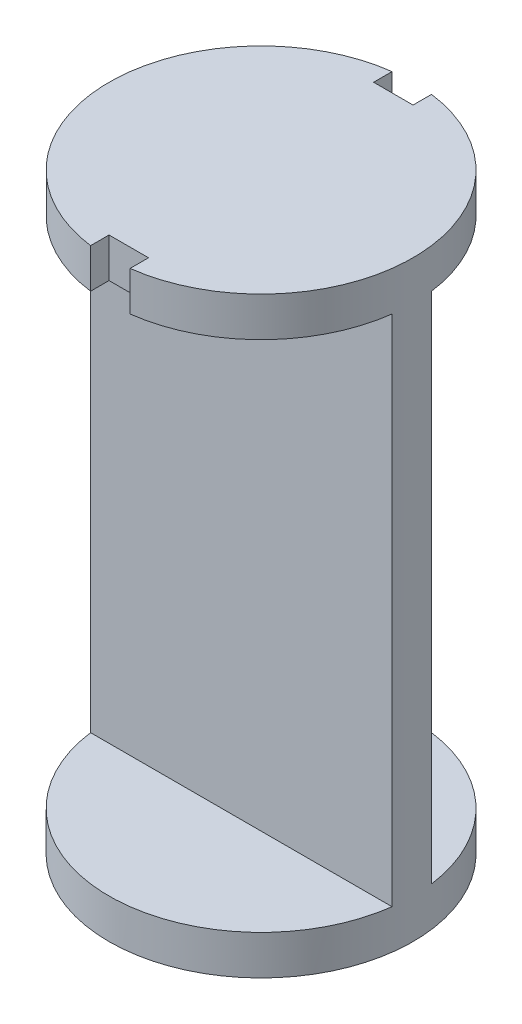
ISO-10303-21;
HEADER;
FILE_DESCRIPTION(('STEP AP214'),'2;1');
FILE_NAME('part.step','',(''),(''),'','','');
FILE_SCHEMA(('AUTOMOTIVE_DESIGN { 1 0 10303 214 1 1 1 1 }'));
ENDSEC;
DATA;
#1=APPLICATION_CONTEXT('core data for automotive mechanical design processes');
#2=APPLICATION_PROTOCOL_DEFINITION('international standard','automotive_design',2000,#1);
#3=PRODUCT_CONTEXT('',#1,'mechanical');
#4=PRODUCT('Part','Part','',(#3));
#5=PRODUCT_RELATED_PRODUCT_CATEGORY('part','',(#4));
#6=PRODUCT_DEFINITION_FORMATION('','',#4);
#7=PRODUCT_DEFINITION_CONTEXT('part definition',#1,'design');
#8=PRODUCT_DEFINITION('design','',#6,#7);
#9=PRODUCT_DEFINITION_SHAPE('','',#8);
#10=(LENGTH_UNIT() NAMED_UNIT(*) SI_UNIT(.MILLI.,.METRE.));
#11=(NAMED_UNIT(*) PLANE_ANGLE_UNIT() SI_UNIT($,.RADIAN.));
#12=(NAMED_UNIT(*) SI_UNIT($,.STERADIAN.) SOLID_ANGLE_UNIT());
#13=UNCERTAINTY_MEASURE_WITH_UNIT(LENGTH_MEASURE(1.E-05),#10,'distance_accuracy_value','');
#14=(GEOMETRIC_REPRESENTATION_CONTEXT(3) GLOBAL_UNCERTAINTY_ASSIGNED_CONTEXT((#13)) GLOBAL_UNIT_ASSIGNED_CONTEXT((#10,
#11,#12)) REPRESENTATION_CONTEXT('',''));
#15=CARTESIAN_POINT('',(0.,0.,0.));
#16=DIRECTION('',(0.,0.,1.));
#17=DIRECTION('',(1.,0.,0.));
#18=AXIS2_PLACEMENT_3D('',#15,#16,#17);
#19=CARTESIAN_POINT('',(0.,10.,0.));
#20=DIRECTION('',(0.,1.,0.));
#21=DIRECTION('',(0.,0.,1.));
#22=AXIS2_PLACEMENT_3D('',#19,#20,#21);
#23=PLANE('',#22);
#24=DIRECTION('',(-1.,0.,0.));
#25=VECTOR('',#24,1.);
#26=CARTESIAN_POINT('',(38.1739439932528,10.,-5.));
#27=LINE('',#26,#25);
#28=CARTESIAN_POINT('',(38.1739439932528,10.,-5.));
#29=VERTEX_POINT('',#28);
#30=CARTESIAN_POINT('',(-38.1739439932528,10.,-5.));
#31=VERTEX_POINT('',#30);
#32=EDGE_CURVE('E184',#29,#31,#27,.T.);
#33=ORIENTED_EDGE('',*,*,#32,.F.);
#34=CARTESIAN_POINT('',(0.,10.,0.));
#35=DIRECTION('',(0.,1.,0.));
#36=DIRECTION('',(0.,0.,1.));
#37=AXIS2_PLACEMENT_3D('',#34,#35,#36);
#38=CIRCLE('',#37,38.5);
#39=EDGE_CURVE('E11',#29,#31,#38,.T.);
#40=ORIENTED_EDGE('',*,*,#39,.T.);
#41=EDGE_LOOP('',(#33,#40));
#42=FACE_BOUND('',#41,.T.);
#43=ADVANCED_FACE('F43',(#42),#23,.T.);
#44=CARTESIAN_POINT('',(0.,10.,0.));
#45=DIRECTION('',(0.,-1.,0.));
#46=DIRECTION('',(0.,0.,-1.));
#47=AXIS2_PLACEMENT_3D('',#44,#45,#46);
#48=CYLINDRICAL_SURFACE('',#47,38.5);
#49=CARTESIAN_POINT('',(0.,0.,0.));
#50=DIRECTION('',(0.,1.,0.));
#51=DIRECTION('',(0.,0.,1.));
#52=AXIS2_PLACEMENT_3D('',#49,#50,#51);
#53=CIRCLE('',#52,38.5);
#54=CARTESIAN_POINT('',(0.,0.,38.5));
#55=VERTEX_POINT('',#54);
#56=EDGE_CURVE('E47',#55,#55,#53,.T.);
#57=ORIENTED_EDGE('',*,*,#56,.T.);
#58=EDGE_LOOP('',(#57));
#59=FACE_BOUND('',#58,.T.);
#60=CARTESIAN_POINT('',(0.,140.,0.));
#61=DIRECTION('',(0.,1.,0.));
#62=DIRECTION('',(0.,0.,1.));
#63=AXIS2_PLACEMENT_3D('',#60,#61,#62);
#64=CIRCLE('',#63,38.5);
#65=CARTESIAN_POINT('',(38.1739439932528,140.,-5.));
#66=VERTEX_POINT('',#65);
#67=CARTESIAN_POINT('',(5.,140.,-38.1739439932528));
#68=VERTEX_POINT('',#67);
#69=EDGE_CURVE('E151',#66,#68,#64,.T.);
#70=ORIENTED_EDGE('',*,*,#69,.T.);
#71=DIRECTION('',(0.,-1.,0.));
#72=VECTOR('',#71,1.);
#73=CARTESIAN_POINT('',(5.,10.,-38.1739439932528));
#74=LINE('',#73,#72);
#75=CARTESIAN_POINT('',(5.,150.,-38.1739439932528));
#76=VERTEX_POINT('',#75);
#77=EDGE_CURVE('E133',#76,#68,#74,.T.);
#78=ORIENTED_EDGE('',*,*,#77,.F.);
#79=CARTESIAN_POINT('',(0.,150.,0.));
#80=DIRECTION('',(0.,1.,0.));
#81=DIRECTION('',(0.,0.,1.));
#82=AXIS2_PLACEMENT_3D('',#79,#80,#81);
#83=CIRCLE('',#82,38.5);
#84=CARTESIAN_POINT('',(5.,150.,38.1739439932528));
#85=VERTEX_POINT('',#84);
#86=EDGE_CURVE('E173',#85,#76,#83,.T.);
#87=ORIENTED_EDGE('',*,*,#86,.F.);
#88=DIRECTION('',(0.,-1.,0.));
#89=VECTOR('',#88,1.);
#90=CARTESIAN_POINT('',(5.,10.,38.1739439932528));
#91=LINE('',#90,#89);
#92=CARTESIAN_POINT('',(5.,140.,38.1739439932528));
#93=VERTEX_POINT('',#92);
#94=EDGE_CURVE('E67',#93,#85,#91,.F.);
#95=ORIENTED_EDGE('',*,*,#94,.F.);
#96=CARTESIAN_POINT('',(38.1739439932528,140.,5.));
#97=VERTEX_POINT('',#96);
#98=EDGE_CURVE('E166',#93,#97,#64,.T.);
#99=ORIENTED_EDGE('',*,*,#98,.T.);
#100=DIRECTION('',(0.,-1.,0.));
#101=VECTOR('',#100,1.);
#102=CARTESIAN_POINT('',(38.1739439932528,150.002,5.));
#103=LINE('',#102,#101);
#104=CARTESIAN_POINT('',(38.1739439932528,10.,5.));
#105=VERTEX_POINT('',#104);
#106=EDGE_CURVE('E191',#97,#105,#103,.T.);
#107=ORIENTED_EDGE('',*,*,#106,.T.);
#108=CARTESIAN_POINT('',(-38.1739439932528,10.,5.));
#109=VERTEX_POINT('',#108);
#110=EDGE_CURVE('E52',#109,#105,#38,.T.);
#111=ORIENTED_EDGE('',*,*,#110,.F.);
#112=DIRECTION('',(0.,-1.,0.));
#113=VECTOR('',#112,1.);
#114=CARTESIAN_POINT('',(-38.1739439932528,150.002,5.));
#115=LINE('',#114,#113);
#116=CARTESIAN_POINT('',(-38.1739439932528,140.,5.));
#117=VERTEX_POINT('',#116);
#118=EDGE_CURVE('E188',#117,#109,#115,.T.);
#119=ORIENTED_EDGE('',*,*,#118,.F.);
#120=CARTESIAN_POINT('',(-4.99999999999999,140.,38.1739439932528));
#121=VERTEX_POINT('',#120);
#122=EDGE_CURVE('E163',#117,#121,#64,.T.);
#123=ORIENTED_EDGE('',*,*,#122,.T.);
#124=DIRECTION('',(0.,-1.,0.));
#125=VECTOR('',#124,1.);
#126=CARTESIAN_POINT('',(-4.99999999999999,10.,38.1739439932528));
#127=LINE('',#126,#125);
#128=CARTESIAN_POINT('',(-4.99999999999999,150.,38.1739439932528));
#129=VERTEX_POINT('',#128);
#130=EDGE_CURVE('E144',#129,#121,#127,.T.);
#131=ORIENTED_EDGE('',*,*,#130,.F.);
#132=CARTESIAN_POINT('',(-5.,150.,-38.1739439932528));
#133=VERTEX_POINT('',#132);
#134=EDGE_CURVE('E177',#133,#129,#83,.T.);
#135=ORIENTED_EDGE('',*,*,#134,.F.);
#136=DIRECTION('',(0.,-1.,0.));
#137=VECTOR('',#136,1.);
#138=CARTESIAN_POINT('',(-5.,10.,-38.1739439932528));
#139=LINE('',#138,#137);
#140=CARTESIAN_POINT('',(-5.,140.,-38.1739439932528));
#141=VERTEX_POINT('',#140);
#142=EDGE_CURVE('E59',#141,#133,#139,.F.);
#143=ORIENTED_EDGE('',*,*,#142,.F.);
#144=CARTESIAN_POINT('',(-38.1739439932528,140.,-5.));
#145=VERTEX_POINT('',#144);
#146=EDGE_CURVE('E161',#141,#145,#64,.T.);
#147=ORIENTED_EDGE('',*,*,#146,.T.);
#148=DIRECTION('',(0.,-1.,0.));
#149=VECTOR('',#148,1.);
#150=CARTESIAN_POINT('',(-38.1739439932528,150.002,-5.));
#151=LINE('',#150,#149);
#152=EDGE_CURVE('E187',#145,#31,#151,.T.);
#153=ORIENTED_EDGE('',*,*,#152,.T.);
#154=ORIENTED_EDGE('',*,*,#39,.F.);
#155=DIRECTION('',(0.,-1.,0.));
#156=VECTOR('',#155,1.);
#157=CARTESIAN_POINT('',(38.1739439932528,150.002,-5.));
#158=LINE('',#157,#156);
#159=EDGE_CURVE('E159',#66,#29,#158,.T.);
#160=ORIENTED_EDGE('',*,*,#159,.F.);
#161=EDGE_LOOP('',(#70,#78,#87,#95,#99,#107,#111,#119,#123,#131,#135,#143,#147,#153,#154,#160));
#162=FACE_BOUND('',#161,.T.);
#163=ADVANCED_FACE('F45',(#59,#162),#48,.T.);
#164=DIRECTION('',(1.,0.,0.));
#165=VECTOR('',#164,1.);
#166=CARTESIAN_POINT('',(38.1739439932528,10.,5.));
#167=LINE('',#166,#165);
#168=EDGE_CURVE('E181',#109,#105,#167,.T.);
#169=ORIENTED_EDGE('',*,*,#168,.F.);
#170=ORIENTED_EDGE('',*,*,#110,.T.);
#171=EDGE_LOOP('',(#169,#170));
#172=FACE_BOUND('',#171,.T.);
#173=ADVANCED_FACE('F206',(#172),#23,.T.);
#174=CARTESIAN_POINT('',(0.,0.,0.));
#175=DIRECTION('',(0.,1.,0.));
#176=DIRECTION('',(0.,0.,1.));
#177=AXIS2_PLACEMENT_3D('',#174,#175,#176);
#178=PLANE('',#177);
#179=ORIENTED_EDGE('',*,*,#56,.F.);
#180=EDGE_LOOP('',(#179));
#181=FACE_BOUND('',#180,.T.);
#182=ADVANCED_FACE('F203',(#181),#178,.F.);
#183=CARTESIAN_POINT('',(38.1739439932528,150.002,5.));
#184=DIRECTION('',(0.,0.,-1.));
#185=DIRECTION('',(-1.,0.,0.));
#186=AXIS2_PLACEMENT_3D('',#183,#184,#185);
#187=PLANE('',#186);
#188=DIRECTION('',(1.,0.,0.));
#189=VECTOR('',#188,1.);
#190=CARTESIAN_POINT('',(38.1739439932528,140.,5.));
#191=LINE('',#190,#189);
#192=EDGE_CURVE('E164',#117,#97,#191,.T.);
#193=ORIENTED_EDGE('',*,*,#192,.F.);
#194=ORIENTED_EDGE('',*,*,#118,.T.);
#195=ORIENTED_EDGE('',*,*,#168,.T.);
#196=ORIENTED_EDGE('',*,*,#106,.F.);
#197=EDGE_LOOP('',(#193,#194,#195,#196));
#198=FACE_BOUND('',#197,.T.);
#199=ADVANCED_FACE('F205',(#198),#187,.F.);
#200=CARTESIAN_POINT('',(38.1739439932528,150.002,-5.));
#201=DIRECTION('',(0.,0.,1.));
#202=DIRECTION('',(1.,0.,0.));
#203=AXIS2_PLACEMENT_3D('',#200,#201,#202);
#204=PLANE('',#203);
#205=DIRECTION('',(-1.,0.,0.));
#206=VECTOR('',#205,1.);
#207=CARTESIAN_POINT('',(38.1739439932528,140.,-5.));
#208=LINE('',#207,#206);
#209=EDGE_CURVE('E160',#66,#145,#208,.T.);
#210=ORIENTED_EDGE('',*,*,#209,.F.);
#211=ORIENTED_EDGE('',*,*,#159,.T.);
#212=ORIENTED_EDGE('',*,*,#32,.T.);
#213=ORIENTED_EDGE('',*,*,#152,.F.);
#214=EDGE_LOOP('',(#210,#211,#212,#213));
#215=FACE_BOUND('',#214,.T.);
#216=ADVANCED_FACE('F207',(#215),#204,.F.);
#217=CARTESIAN_POINT('',(0.,140.,0.));
#218=DIRECTION('',(0.,1.,0.));
#219=DIRECTION('',(0.,0.,1.));
#220=AXIS2_PLACEMENT_3D('',#217,#218,#219);
#221=PLANE('',#220);
#222=DIRECTION('',(1.,0.,0.));
#223=VECTOR('',#222,1.);
#224=CARTESIAN_POINT('',(5.,140.,33.5));
#225=LINE('',#224,#223);
#226=CARTESIAN_POINT('',(-4.99999999999999,140.,33.5));
#227=VERTEX_POINT('',#226);
#228=CARTESIAN_POINT('',(5.,140.,33.5));
#229=VERTEX_POINT('',#228);
#230=EDGE_CURVE('E363',#227,#229,#225,.T.);
#231=ORIENTED_EDGE('',*,*,#230,.F.);
#232=DIRECTION('',(0.,0.,-1.));
#233=VECTOR('',#232,1.);
#234=CARTESIAN_POINT('',(-4.99999999999999,140.,43.5));
#235=LINE('',#234,#233);
#236=EDGE_CURVE('E379',#121,#227,#235,.T.);
#237=ORIENTED_EDGE('',*,*,#236,.F.);
#238=ORIENTED_EDGE('',*,*,#122,.F.);
#239=ORIENTED_EDGE('',*,*,#192,.T.);
#240=ORIENTED_EDGE('',*,*,#98,.F.);
#241=DIRECTION('',(0.,0.,1.));
#242=VECTOR('',#241,1.);
#243=CARTESIAN_POINT('',(5.,140.,43.5));
#244=LINE('',#243,#242);
#245=EDGE_CURVE('E377',#229,#93,#244,.T.);
#246=ORIENTED_EDGE('',*,*,#245,.F.);
#247=EDGE_LOOP('',(#231,#237,#238,#239,#240,#246));
#248=FACE_BOUND('',#247,.T.);
#249=ADVANCED_FACE('F214',(#248),#221,.F.);
#250=DIRECTION('',(-1.,0.,0.));
#251=VECTOR('',#250,1.);
#252=CARTESIAN_POINT('',(5.,140.,-33.5));
#253=LINE('',#252,#251);
#254=CARTESIAN_POINT('',(5.,140.,-33.5));
#255=VERTEX_POINT('',#254);
#256=CARTESIAN_POINT('',(-5.,140.,-33.5));
#257=VERTEX_POINT('',#256);
#258=EDGE_CURVE('E153',#255,#257,#253,.T.);
#259=ORIENTED_EDGE('',*,*,#258,.F.);
#260=DIRECTION('',(0.,0.,1.));
#261=VECTOR('',#260,1.);
#262=CARTESIAN_POINT('',(5.,140.,-43.5));
#263=LINE('',#262,#261);
#264=EDGE_CURVE('E136',#68,#255,#263,.T.);
#265=ORIENTED_EDGE('',*,*,#264,.F.);
#266=ORIENTED_EDGE('',*,*,#69,.F.);
#267=ORIENTED_EDGE('',*,*,#209,.T.);
#268=ORIENTED_EDGE('',*,*,#146,.F.);
#269=DIRECTION('',(0.,0.,-1.));
#270=VECTOR('',#269,1.);
#271=CARTESIAN_POINT('',(-5.,140.,-43.5));
#272=LINE('',#271,#270);
#273=EDGE_CURVE('E154',#257,#141,#272,.T.);
#274=ORIENTED_EDGE('',*,*,#273,.F.);
#275=EDGE_LOOP('',(#259,#265,#266,#267,#268,#274));
#276=FACE_BOUND('',#275,.T.);
#277=ADVANCED_FACE('F149',(#276),#221,.F.);
#278=CARTESIAN_POINT('',(0.,150.,0.));
#279=DIRECTION('',(0.,1.,0.));
#280=DIRECTION('',(0.,0.,1.));
#281=AXIS2_PLACEMENT_3D('',#278,#279,#280);
#282=PLANE('',#281);
#283=DIRECTION('',(0.,0.,-1.));
#284=VECTOR('',#283,1.);
#285=CARTESIAN_POINT('',(5.,150.,-43.5));
#286=LINE('',#285,#284);
#287=CARTESIAN_POINT('',(5.,150.,-33.5));
#288=VERTEX_POINT('',#287);
#289=EDGE_CURVE('E139',#288,#76,#286,.T.);
#290=ORIENTED_EDGE('',*,*,#289,.F.);
#291=DIRECTION('',(1.,0.,0.));
#292=VECTOR('',#291,1.);
#293=CARTESIAN_POINT('',(5.,150.,-33.5));
#294=LINE('',#293,#292);
#295=CARTESIAN_POINT('',(-5.,150.,-33.5));
#296=VERTEX_POINT('',#295);
#297=EDGE_CURVE('E356',#296,#288,#294,.T.);
#298=ORIENTED_EDGE('',*,*,#297,.F.);
#299=DIRECTION('',(0.,0.,1.));
#300=VECTOR('',#299,1.);
#301=CARTESIAN_POINT('',(-5.,150.,-43.5));
#302=LINE('',#301,#300);
#303=EDGE_CURVE('E351',#133,#296,#302,.T.);
#304=ORIENTED_EDGE('',*,*,#303,.F.);
#305=ORIENTED_EDGE('',*,*,#134,.T.);
#306=DIRECTION('',(0.,0.,1.));
#307=VECTOR('',#306,1.);
#308=CARTESIAN_POINT('',(-4.99999999999999,150.,43.5));
#309=LINE('',#308,#307);
#310=CARTESIAN_POINT('',(-4.99999999999999,150.,33.5));
#311=VERTEX_POINT('',#310);
#312=EDGE_CURVE('E369',#311,#129,#309,.T.);
#313=ORIENTED_EDGE('',*,*,#312,.F.);
#314=DIRECTION('',(-1.,0.,0.));
#315=VECTOR('',#314,1.);
#316=CARTESIAN_POINT('',(5.,150.,33.5));
#317=LINE('',#316,#315);
#318=CARTESIAN_POINT('',(5.,150.,33.5));
#319=VERTEX_POINT('',#318);
#320=EDGE_CURVE('E372',#319,#311,#317,.T.);
#321=ORIENTED_EDGE('',*,*,#320,.F.);
#322=DIRECTION('',(0.,0.,-1.));
#323=VECTOR('',#322,1.);
#324=CARTESIAN_POINT('',(5.,150.,43.5));
#325=LINE('',#324,#323);
#326=EDGE_CURVE('E375',#85,#319,#325,.T.);
#327=ORIENTED_EDGE('',*,*,#326,.F.);
#328=ORIENTED_EDGE('',*,*,#86,.T.);
#329=EDGE_LOOP('',(#290,#298,#304,#305,#313,#321,#327,#328));
#330=FACE_BOUND('',#329,.T.);
#331=ADVANCED_FACE('F225',(#330),#282,.T.);
#332=CARTESIAN_POINT('',(5.,-0.001000000000001,33.5));
#333=DIRECTION('',(0.,0.,-1.));
#334=DIRECTION('',(-1.,0.,0.));
#335=AXIS2_PLACEMENT_3D('',#332,#333,#334);
#336=PLANE('',#335);
#337=ORIENTED_EDGE('',*,*,#230,.T.);
#338=DIRECTION('',(0.,1.,0.));
#339=VECTOR('',#338,1.);
#340=CARTESIAN_POINT('',(5.,-0.001000000000001,33.5));
#341=LINE('',#340,#339);
#342=EDGE_CURVE('E367',#229,#319,#341,.T.);
#343=ORIENTED_EDGE('',*,*,#342,.T.);
#344=ORIENTED_EDGE('',*,*,#320,.T.);
#345=DIRECTION('',(0.,1.,0.));
#346=VECTOR('',#345,1.);
#347=CARTESIAN_POINT('',(-4.99999999999999,-0.001000000000001,33.5));
#348=LINE('',#347,#346);
#349=EDGE_CURVE('E366',#227,#311,#348,.T.);
#350=ORIENTED_EDGE('',*,*,#349,.F.);
#351=EDGE_LOOP('',(#337,#343,#344,#350));
#352=FACE_BOUND('',#351,.T.);
#353=ADVANCED_FACE('F228',(#352),#336,.F.);
#354=CARTESIAN_POINT('',(-4.99999999999999,-0.001000000000001,43.5));
#355=DIRECTION('',(-1.,0.,0.));
#356=DIRECTION('',(0.,0.,1.));
#357=AXIS2_PLACEMENT_3D('',#354,#355,#356);
#358=PLANE('',#357);
#359=ORIENTED_EDGE('',*,*,#130,.T.);
#360=ORIENTED_EDGE('',*,*,#236,.T.);
#361=ORIENTED_EDGE('',*,*,#349,.T.);
#362=ORIENTED_EDGE('',*,*,#312,.T.);
#363=EDGE_LOOP('',(#359,#360,#361,#362));
#364=FACE_BOUND('',#363,.T.);
#365=ADVANCED_FACE('F232',(#364),#358,.F.);
#366=CARTESIAN_POINT('',(5.,-0.001000000000001,43.5));
#367=DIRECTION('',(1.,0.,0.));
#368=DIRECTION('',(0.,0.,-1.));
#369=AXIS2_PLACEMENT_3D('',#366,#367,#368);
#370=PLANE('',#369);
#371=ORIENTED_EDGE('',*,*,#94,.T.);
#372=ORIENTED_EDGE('',*,*,#326,.T.);
#373=ORIENTED_EDGE('',*,*,#342,.F.);
#374=ORIENTED_EDGE('',*,*,#245,.T.);
#375=EDGE_LOOP('',(#371,#372,#373,#374));
#376=FACE_BOUND('',#375,.T.);
#377=ADVANCED_FACE('F235',(#376),#370,.F.);
#378=CARTESIAN_POINT('',(5.,-0.001000000000001,-33.5));
#379=DIRECTION('',(0.,0.,1.));
#380=DIRECTION('',(1.,0.,0.));
#381=AXIS2_PLACEMENT_3D('',#378,#379,#380);
#382=PLANE('',#381);
#383=ORIENTED_EDGE('',*,*,#258,.T.);
#384=DIRECTION('',(0.,1.,0.));
#385=VECTOR('',#384,1.);
#386=CARTESIAN_POINT('',(-5.,-0.001000000000001,-33.5));
#387=LINE('',#386,#385);
#388=EDGE_CURVE('E348',#257,#296,#387,.T.);
#389=ORIENTED_EDGE('',*,*,#388,.T.);
#390=ORIENTED_EDGE('',*,*,#297,.T.);
#391=DIRECTION('',(0.,1.,0.));
#392=VECTOR('',#391,1.);
#393=CARTESIAN_POINT('',(5.,-0.001000000000001,-33.5));
#394=LINE('',#393,#392);
#395=EDGE_CURVE('E349',#255,#288,#394,.T.);
#396=ORIENTED_EDGE('',*,*,#395,.F.);
#397=EDGE_LOOP('',(#383,#389,#390,#396));
#398=FACE_BOUND('',#397,.T.);
#399=ADVANCED_FACE('F242',(#398),#382,.F.);
#400=CARTESIAN_POINT('',(5.,-0.001000000000001,-43.5));
#401=DIRECTION('',(1.,0.,0.));
#402=DIRECTION('',(0.,0.,-1.));
#403=AXIS2_PLACEMENT_3D('',#400,#401,#402);
#404=PLANE('',#403);
#405=ORIENTED_EDGE('',*,*,#77,.T.);
#406=ORIENTED_EDGE('',*,*,#264,.T.);
#407=ORIENTED_EDGE('',*,*,#395,.T.);
#408=ORIENTED_EDGE('',*,*,#289,.T.);
#409=EDGE_LOOP('',(#405,#406,#407,#408));
#410=FACE_BOUND('',#409,.T.);
#411=ADVANCED_FACE('F135',(#410),#404,.F.);
#412=CARTESIAN_POINT('',(-5.,-0.001000000000001,-43.5));
#413=DIRECTION('',(-1.,0.,0.));
#414=DIRECTION('',(0.,0.,1.));
#415=AXIS2_PLACEMENT_3D('',#412,#413,#414);
#416=PLANE('',#415);
#417=ORIENTED_EDGE('',*,*,#142,.T.);
#418=ORIENTED_EDGE('',*,*,#303,.T.);
#419=ORIENTED_EDGE('',*,*,#388,.F.);
#420=ORIENTED_EDGE('',*,*,#273,.T.);
#421=EDGE_LOOP('',(#417,#418,#419,#420));
#422=FACE_BOUND('',#421,.T.);
#423=ADVANCED_FACE('F243',(#422),#416,.F.);
#424=CLOSED_SHELL('',(#43,#163,#173,#182,#199,#216,#249,#277,#331,#353,#365,#377,#399,#411,#423));
#425=MANIFOLD_SOLID_BREP('B2',#424);
#426=ADVANCED_BREP_SHAPE_REPRESENTATION('',(#18,#425),#14);
#427=SHAPE_DEFINITION_REPRESENTATION(#9,#426);
ENDSEC;
END-ISO-10303-21;
